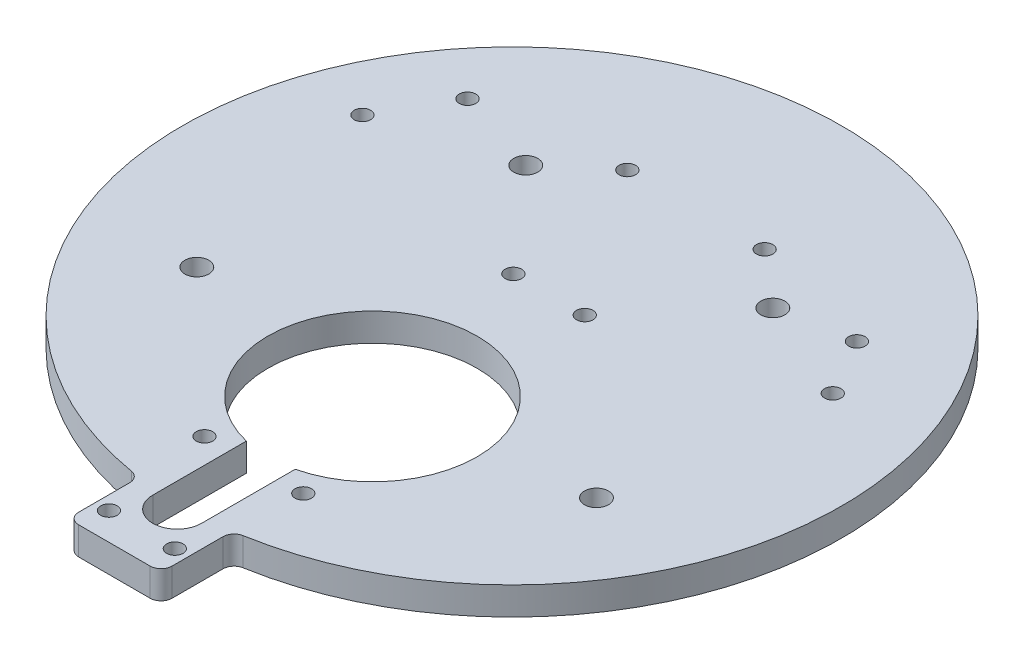
ISO-10303-21;
HEADER;
FILE_DESCRIPTION(('STEP AP214'),'2;1');
FILE_NAME('part.step','',(''),(''),'','','');
FILE_SCHEMA(('AUTOMOTIVE_DESIGN { 1 0 10303 214 1 1 1 1 }'));
ENDSEC;
DATA;
#1=APPLICATION_CONTEXT('core data for automotive mechanical design processes');
#2=APPLICATION_PROTOCOL_DEFINITION('international standard','automotive_design',2000,#1);
#3=PRODUCT_CONTEXT('',#1,'mechanical');
#4=PRODUCT('Part','Part','',(#3));
#5=PRODUCT_RELATED_PRODUCT_CATEGORY('part','',(#4));
#6=PRODUCT_DEFINITION_FORMATION('','',#4);
#7=PRODUCT_DEFINITION_CONTEXT('part definition',#1,'design');
#8=PRODUCT_DEFINITION('design','',#6,#7);
#9=PRODUCT_DEFINITION_SHAPE('','',#8);
#10=(LENGTH_UNIT() NAMED_UNIT(*) SI_UNIT(.MILLI.,.METRE.));
#11=(NAMED_UNIT(*) PLANE_ANGLE_UNIT() SI_UNIT($,.RADIAN.));
#12=(NAMED_UNIT(*) SI_UNIT($,.STERADIAN.) SOLID_ANGLE_UNIT());
#13=UNCERTAINTY_MEASURE_WITH_UNIT(LENGTH_MEASURE(1.E-05),#10,'distance_accuracy_value','');
#14=(GEOMETRIC_REPRESENTATION_CONTEXT(3) GLOBAL_UNCERTAINTY_ASSIGNED_CONTEXT((#13)) GLOBAL_UNIT_ASSIGNED_CONTEXT((#10,
#11,#12)) REPRESENTATION_CONTEXT('',''));
#15=CARTESIAN_POINT('',(0.,0.,0.));
#16=DIRECTION('',(0.,0.,1.));
#17=DIRECTION('',(1.,0.,0.));
#18=AXIS2_PLACEMENT_3D('',#15,#16,#17);
#19=CARTESIAN_POINT('',(0.,5.08,0.));
#20=DIRECTION('',(0.,-1.,0.));
#21=DIRECTION('',(0.,0.,-1.));
#22=AXIS2_PLACEMENT_3D('',#19,#20,#21);
#23=CYLINDRICAL_SURFACE('',#22,60.);
#24=CARTESIAN_POINT('',(0.,5.08,0.));
#25=DIRECTION('',(0.,1.,0.));
#26=DIRECTION('',(0.,0.,1.));
#27=AXIS2_PLACEMENT_3D('',#24,#25,#26);
#28=CIRCLE('',#27,60.);
#29=CARTESIAN_POINT('',(10.1612903225807,5.08,59.1333085407897));
#30=VERTEX_POINT('',#29);
#31=CARTESIAN_POINT('',(-10.1612903225806,5.08,59.1333085407897));
#32=VERTEX_POINT('',#31);
#33=EDGE_CURVE('E230',#30,#32,#28,.T.);
#34=ORIENTED_EDGE('',*,*,#33,.F.);
#35=DIRECTION('',(0.,-1.,0.));
#36=VECTOR('',#35,1.);
#37=CARTESIAN_POINT('',(10.1612903225807,5.08,59.1333085407897));
#38=LINE('',#37,#36);
#39=CARTESIAN_POINT('',(10.1612903225807,0.,59.1333085407897));
#40=VERTEX_POINT('',#39);
#41=EDGE_CURVE('E259',#30,#40,#38,.T.);
#42=ORIENTED_EDGE('',*,*,#41,.T.);
#43=CARTESIAN_POINT('',(0.,0.,0.));
#44=DIRECTION('',(0.,1.,0.));
#45=DIRECTION('',(0.,0.,1.));
#46=AXIS2_PLACEMENT_3D('',#43,#44,#45);
#47=CIRCLE('',#46,60.);
#48=CARTESIAN_POINT('',(-10.1612903225806,0.,59.1333085407897));
#49=VERTEX_POINT('',#48);
#50=EDGE_CURVE('E227',#40,#49,#47,.T.);
#51=ORIENTED_EDGE('',*,*,#50,.T.);
#52=DIRECTION('',(0.,-1.,0.));
#53=VECTOR('',#52,1.);
#54=CARTESIAN_POINT('',(-10.1612903225806,5.08,59.1333085407897));
#55=LINE('',#54,#53);
#56=EDGE_CURVE('E256',#49,#32,#55,.F.);
#57=ORIENTED_EDGE('',*,*,#56,.T.);
#58=EDGE_LOOP('',(#34,#42,#51,#57));
#59=FACE_BOUND('',#58,.T.);
#60=ADVANCED_FACE('F35',(#59),#23,.T.);
#61=CARTESIAN_POINT('',(0.,5.08,0.));
#62=DIRECTION('',(0.,1.,0.));
#63=DIRECTION('',(0.,0.,1.));
#64=AXIS2_PLACEMENT_3D('',#61,#62,#63);
#65=PLANE('',#64);
#66=CARTESIAN_POINT('',(9.,5.08,47.));
#67=DIRECTION('',(0.,1.,0.));
#68=DIRECTION('',(0.,0.,1.));
#69=AXIS2_PLACEMENT_3D('',#66,#67,#68);
#70=CIRCLE('',#69,1.5);
#71=CARTESIAN_POINT('',(9.,5.08,48.5));
#72=VERTEX_POINT('',#71);
#73=EDGE_CURVE('E684',#72,#72,#70,.T.);
#74=ORIENTED_EDGE('',*,*,#73,.F.);
#75=EDGE_LOOP('',(#74));
#76=FACE_BOUND('',#75,.T.);
#77=CARTESIAN_POINT('',(-9.,5.08,47.));
#78=DIRECTION('',(0.,1.,0.));
#79=DIRECTION('',(0.,0.,1.));
#80=AXIS2_PLACEMENT_3D('',#77,#78,#79);
#81=CIRCLE('',#80,1.5);
#82=CARTESIAN_POINT('',(-9.,5.08,48.5));
#83=VERTEX_POINT('',#82);
#84=EDGE_CURVE('E678',#83,#83,#81,.T.);
#85=ORIENTED_EDGE('',*,*,#84,.F.);
#86=EDGE_LOOP('',(#85));
#87=FACE_BOUND('',#86,.T.);
#88=CARTESIAN_POINT('',(6.,5.08,67.394865097919));
#89=DIRECTION('',(0.,1.,0.));
#90=DIRECTION('',(0.,0.,1.));
#91=AXIS2_PLACEMENT_3D('',#88,#89,#90);
#92=CIRCLE('',#91,1.5);
#93=CARTESIAN_POINT('',(6.,5.08,68.894865097919));
#94=VERTEX_POINT('',#93);
#95=EDGE_CURVE('E672',#94,#94,#92,.T.);
#96=ORIENTED_EDGE('',*,*,#95,.F.);
#97=EDGE_LOOP('',(#96));
#98=FACE_BOUND('',#97,.T.);
#99=CARTESIAN_POINT('',(-6.,5.08,67.394865097919));
#100=DIRECTION('',(0.,1.,0.));
#101=DIRECTION('',(0.,0.,1.));
#102=AXIS2_PLACEMENT_3D('',#99,#100,#101);
#103=CIRCLE('',#102,1.5);
#104=CARTESIAN_POINT('',(-6.,5.08,68.894865097919));
#105=VERTEX_POINT('',#104);
#106=EDGE_CURVE('E662',#105,#105,#103,.T.);
#107=ORIENTED_EDGE('',*,*,#106,.F.);
#108=EDGE_LOOP('',(#107));
#109=FACE_BOUND('',#108,.T.);
#110=DIRECTION('',(0.,0.,-1.));
#111=VECTOR('',#110,1.);
#112=CARTESIAN_POINT('',(4.44500000000001,5.08,60.964865097919));
#113=LINE('',#112,#111);
#114=CARTESIAN_POINT('',(4.445,5.08,60.964865097919));
#115=VERTEX_POINT('',#114);
#116=CARTESIAN_POINT('',(4.44499999999999,5.08,43.9241592251848));
#117=VERTEX_POINT('',#116);
#118=EDGE_CURVE('E129',#115,#117,#113,.T.);
#119=ORIENTED_EDGE('',*,*,#118,.F.);
#120=CARTESIAN_POINT('',(0.,5.08,60.964865097919));
#121=DIRECTION('',(0.,1.,0.));
#122=DIRECTION('',(0.,0.,1.));
#123=AXIS2_PLACEMENT_3D('',#120,#121,#122);
#124=CIRCLE('',#123,4.445);
#125=CARTESIAN_POINT('',(-4.44499999999998,5.08,60.964865097919));
#126=VERTEX_POINT('',#125);
#127=EDGE_CURVE('E145',#126,#115,#124,.T.);
#128=ORIENTED_EDGE('',*,*,#127,.F.);
#129=DIRECTION('',(0.,0.,1.));
#130=VECTOR('',#129,1.);
#131=CARTESIAN_POINT('',(-4.44499999999998,5.08,60.964865097919));
#132=LINE('',#131,#130);
#133=CARTESIAN_POINT('',(-4.44500000000001,5.08,43.9241592251848));
#134=VERTEX_POINT('',#133);
#135=EDGE_CURVE('E656',#134,#126,#132,.T.);
#136=ORIENTED_EDGE('',*,*,#135,.F.);
#137=CARTESIAN_POINT('',(0.,5.08,25.4));
#138=DIRECTION('',(0.,1.,0.));
#139=DIRECTION('',(0.,0.,1.));
#140=AXIS2_PLACEMENT_3D('',#137,#138,#139);
#141=CIRCLE('',#140,19.05);
#142=EDGE_CURVE('E150',#117,#134,#141,.T.);
#143=ORIENTED_EDGE('',*,*,#142,.F.);
#144=EDGE_LOOP('',(#119,#128,#136,#143));
#145=FACE_BOUND('',#144,.T.);
#146=DIRECTION('',(1.,0.,0.));
#147=VECTOR('',#146,1.);
#148=CARTESIAN_POINT('',(-8.49999999999999,5.08,72.394865097919));
#149=LINE('',#148,#147);
#150=CARTESIAN_POINT('',(-6.49999999999999,5.08,72.394865097919));
#151=VERTEX_POINT('',#150);
#152=CARTESIAN_POINT('',(6.50000000000001,5.08,72.394865097919));
#153=VERTEX_POINT('',#152);
#154=EDGE_CURVE('E158',#151,#153,#149,.T.);
#155=ORIENTED_EDGE('',*,*,#154,.T.);
#156=CARTESIAN_POINT('',(6.50000000000001,5.08,70.394865097919));
#157=DIRECTION('',(0.,1.,0.));
#158=DIRECTION('',(0.,0.,1.));
#159=AXIS2_PLACEMENT_3D('',#156,#157,#158);
#160=CIRCLE('',#159,2.);
#161=CARTESIAN_POINT('',(8.50000000000001,5.08,70.394865097919));
#162=VERTEX_POINT('',#161);
#163=EDGE_CURVE('E241',#153,#162,#160,.T.);
#164=ORIENTED_EDGE('',*,*,#163,.T.);
#165=DIRECTION('',(0.,0.,-1.));
#166=VECTOR('',#165,1.);
#167=CARTESIAN_POINT('',(8.50000000000001,5.08,72.394865097919));
#168=LINE('',#167,#166);
#169=CARTESIAN_POINT('',(8.50000000000001,5.08,61.1044188254827));
#170=VERTEX_POINT('',#169);
#171=EDGE_CURVE('E285',#162,#170,#168,.T.);
#172=ORIENTED_EDGE('',*,*,#171,.T.);
#173=CARTESIAN_POINT('',(10.5,5.08,61.1044188254827));
#174=DIRECTION('',(0.,1.,0.));
#175=DIRECTION('',(0.,0.,1.));
#176=AXIS2_PLACEMENT_3D('',#173,#174,#175);
#177=CIRCLE('',#176,2.);
#178=EDGE_CURVE('E262',#170,#30,#177,.F.);
#179=ORIENTED_EDGE('',*,*,#178,.T.);
#180=ORIENTED_EDGE('',*,*,#33,.T.);
#181=CARTESIAN_POINT('',(-10.5,5.08,61.1044188254827));
#182=DIRECTION('',(0.,1.,0.));
#183=DIRECTION('',(0.,0.,1.));
#184=AXIS2_PLACEMENT_3D('',#181,#182,#183);
#185=CIRCLE('',#184,2.);
#186=CARTESIAN_POINT('',(-8.49999999999999,5.08,61.1044188254827));
#187=VERTEX_POINT('',#186);
#188=EDGE_CURVE('E43',#32,#187,#185,.F.);
#189=ORIENTED_EDGE('',*,*,#188,.T.);
#190=DIRECTION('',(0.,0.,1.));
#191=VECTOR('',#190,1.);
#192=CARTESIAN_POINT('',(-8.49999999999999,5.08,72.394865097919));
#193=LINE('',#192,#191);
#194=CARTESIAN_POINT('',(-8.49999999999999,5.08,70.394865097919));
#195=VERTEX_POINT('',#194);
#196=EDGE_CURVE('E296',#187,#195,#193,.T.);
#197=ORIENTED_EDGE('',*,*,#196,.T.);
#198=CARTESIAN_POINT('',(-6.49999999999999,5.08,70.394865097919));
#199=DIRECTION('',(0.,1.,0.));
#200=DIRECTION('',(0.,0.,1.));
#201=AXIS2_PLACEMENT_3D('',#198,#199,#200);
#202=CIRCLE('',#201,2.);
#203=EDGE_CURVE('E239',#195,#151,#202,.T.);
#204=ORIENTED_EDGE('',*,*,#203,.T.);
#205=EDGE_LOOP('',(#155,#164,#172,#179,#180,#189,#197,#204));
#206=FACE_BOUND('',#205,.T.);
#207=CARTESIAN_POINT('',(22.5,5.08,-25.));
#208=DIRECTION('',(0.,1.,0.));
#209=DIRECTION('',(0.,0.,1.));
#210=AXIS2_PLACEMENT_3D('',#207,#208,#209);
#211=CIRCLE('',#210,2.1828125);
#212=CARTESIAN_POINT('',(22.5,5.08,-22.8171875));
#213=VERTEX_POINT('',#212);
#214=EDGE_CURVE('E149',#213,#213,#211,.T.);
#215=ORIENTED_EDGE('',*,*,#214,.F.);
#216=EDGE_LOOP('',(#215));
#217=FACE_BOUND('',#216,.T.);
#218=CARTESIAN_POINT('',(-22.5,5.08,-25.));
#219=DIRECTION('',(0.,1.,0.));
#220=DIRECTION('',(0.,0.,1.));
#221=AXIS2_PLACEMENT_3D('',#218,#219,#220);
#222=CIRCLE('',#221,2.1828125);
#223=CARTESIAN_POINT('',(-22.5,5.08,-22.8171875));
#224=VERTEX_POINT('',#223);
#225=EDGE_CURVE('E162',#224,#224,#222,.T.);
#226=ORIENTED_EDGE('',*,*,#225,.F.);
#227=EDGE_LOOP('',(#226));
#228=FACE_BOUND('',#227,.T.);
#229=CARTESIAN_POINT('',(-38.2943859866371,5.08,-30.192177826491));
#230=DIRECTION('',(0.,1.,0.));
#231=DIRECTION('',(0.,0.,1.));
#232=AXIS2_PLACEMENT_3D('',#229,#230,#231);
#233=CIRCLE('',#232,1.5);
#234=CARTESIAN_POINT('',(-38.2943859866371,5.08,-28.692177826491));
#235=VERTEX_POINT('',#234);
#236=EDGE_CURVE('E167',#235,#235,#233,.T.);
#237=ORIENTED_EDGE('',*,*,#236,.F.);
#238=EDGE_LOOP('',(#237));
#239=FACE_BOUND('',#238,.T.);
#240=CARTESIAN_POINT('',(-45.294385986637,5.08,-18.0678221735088));
#241=DIRECTION('',(0.,1.,0.));
#242=DIRECTION('',(0.,0.,1.));
#243=AXIS2_PLACEMENT_3D('',#240,#241,#242);
#244=CIRCLE('',#243,1.5);
#245=CARTESIAN_POINT('',(-45.294385986637,5.08,-16.5678221735088));
#246=VERTEX_POINT('',#245);
#247=EDGE_CURVE('E173',#246,#246,#244,.T.);
#248=ORIENTED_EDGE('',*,*,#247,.F.);
#249=EDGE_LOOP('',(#248));
#250=FACE_BOUND('',#249,.T.);
#251=CARTESIAN_POINT('',(41.4212169661505,5.08,-16.9863475352933));
#252=DIRECTION('',(0.,1.,0.));
#253=DIRECTION('',(0.,0.,1.));
#254=AXIS2_PLACEMENT_3D('',#251,#252,#253);
#255=CIRCLE('',#254,1.5);
#256=CARTESIAN_POINT('',(41.4212169661505,5.08,-15.4863475352933));
#257=VERTEX_POINT('',#256);
#258=EDGE_CURVE('E179',#257,#257,#255,.T.);
#259=ORIENTED_EDGE('',*,*,#258,.F.);
#260=EDGE_LOOP('',(#259));
#261=FACE_BOUND('',#260,.T.);
#262=CARTESIAN_POINT('',(35.4212169661505,5.08,-27.3786523807065));
#263=DIRECTION('',(0.,1.,0.));
#264=DIRECTION('',(0.,0.,1.));
#265=AXIS2_PLACEMENT_3D('',#262,#263,#264);
#266=CIRCLE('',#265,1.5);
#267=CARTESIAN_POINT('',(35.4212169661505,5.08,-25.8786523807065));
#268=VERTEX_POINT('',#267);
#269=EDGE_CURVE('E185',#268,#268,#266,.T.);
#270=ORIENTED_EDGE('',*,*,#269,.F.);
#271=EDGE_LOOP('',(#270));
#272=FACE_BOUND('',#271,.T.);
#273=CARTESIAN_POINT('',(12.5,5.08,-33.500000056));
#274=DIRECTION('',(0.,1.,0.));
#275=DIRECTION('',(0.,0.,1.));
#276=AXIS2_PLACEMENT_3D('',#273,#274,#275);
#277=CIRCLE('',#276,1.5);
#278=CARTESIAN_POINT('',(12.5,5.08,-32.000000056));
#279=VERTEX_POINT('',#278);
#280=EDGE_CURVE('E191',#279,#279,#277,.T.);
#281=ORIENTED_EDGE('',*,*,#280,.F.);
#282=EDGE_LOOP('',(#281));
#283=FACE_BOUND('',#282,.T.);
#284=CARTESIAN_POINT('',(-12.5,5.08,-33.500000056));
#285=DIRECTION('',(0.,1.,0.));
#286=DIRECTION('',(0.,0.,1.));
#287=AXIS2_PLACEMENT_3D('',#284,#285,#286);
#288=CIRCLE('',#287,1.5);
#289=CARTESIAN_POINT('',(-12.5,5.08,-32.000000056));
#290=VERTEX_POINT('',#289);
#291=EDGE_CURVE('E197',#290,#290,#288,.T.);
#292=ORIENTED_EDGE('',*,*,#291,.F.);
#293=EDGE_LOOP('',(#292));
#294=FACE_BOUND('',#293,.T.);
#295=CARTESIAN_POINT('',(6.5,5.08,-6.749999962));
#296=DIRECTION('',(0.,1.,0.));
#297=DIRECTION('',(0.,0.,1.));
#298=AXIS2_PLACEMENT_3D('',#295,#296,#297);
#299=CIRCLE('',#298,1.5);
#300=CARTESIAN_POINT('',(6.5,5.08,-5.249999962));
#301=VERTEX_POINT('',#300);
#302=EDGE_CURVE('E203',#301,#301,#299,.T.);
#303=ORIENTED_EDGE('',*,*,#302,.F.);
#304=EDGE_LOOP('',(#303));
#305=FACE_BOUND('',#304,.T.);
#306=CARTESIAN_POINT('',(-6.5,5.08,-6.749999962));
#307=DIRECTION('',(0.,1.,0.));
#308=DIRECTION('',(0.,0.,1.));
#309=AXIS2_PLACEMENT_3D('',#306,#307,#308);
#310=CIRCLE('',#309,1.5);
#311=CARTESIAN_POINT('',(-6.5,5.08,-5.249999962));
#312=VERTEX_POINT('',#311);
#313=EDGE_CURVE('E209',#312,#312,#310,.T.);
#314=ORIENTED_EDGE('',*,*,#313,.F.);
#315=EDGE_LOOP('',(#314));
#316=FACE_BOUND('',#315,.T.);
#317=CARTESIAN_POINT('',(36.3860573781084,5.08,21.0075000219999));
#318=DIRECTION('',(0.,1.,0.));
#319=DIRECTION('',(0.866025403784436,0.,-0.500000000000004));
#320=AXIS2_PLACEMENT_3D('',#317,#318,#319);
#321=CIRCLE('',#320,2.1828125);
#322=CARTESIAN_POINT('',(38.2764284548066,5.08,19.9160937719999));
#323=VERTEX_POINT('',#322);
#324=EDGE_CURVE('E215',#323,#323,#321,.T.);
#325=ORIENTED_EDGE('',*,*,#324,.F.);
#326=EDGE_LOOP('',(#325));
#327=FACE_BOUND('',#326,.T.);
#328=CARTESIAN_POINT('',(-36.3860573781084,5.08,21.0075000219999));
#329=DIRECTION('',(0.,1.,0.));
#330=DIRECTION('',(0.,0.,1.));
#331=AXIS2_PLACEMENT_3D('',#328,#329,#330);
#332=CIRCLE('',#331,2.1828125);
#333=CARTESIAN_POINT('',(-36.3860573781084,5.08,23.1903125219999));
#334=VERTEX_POINT('',#333);
#335=EDGE_CURVE('E221',#334,#334,#332,.T.);
#336=ORIENTED_EDGE('',*,*,#335,.F.);
#337=EDGE_LOOP('',(#336));
#338=FACE_BOUND('',#337,.T.);
#339=ADVANCED_FACE('F283',(#76,#87,#98,#109,#145,#206,#217,#228,#239,#250,#261,#272,#283,#294,
#305,#316,#327,#338),#65,.T.);
#340=CARTESIAN_POINT('',(0.,0.,0.));
#341=DIRECTION('',(0.,1.,0.));
#342=DIRECTION('',(0.,0.,1.));
#343=AXIS2_PLACEMENT_3D('',#340,#341,#342);
#344=PLANE('',#343);
#345=CARTESIAN_POINT('',(9.,0.,47.));
#346=DIRECTION('',(0.,1.,0.));
#347=DIRECTION('',(0.,0.,1.));
#348=AXIS2_PLACEMENT_3D('',#345,#346,#347);
#349=CIRCLE('',#348,1.5);
#350=CARTESIAN_POINT('',(9.,0.,48.5));
#351=VERTEX_POINT('',#350);
#352=EDGE_CURVE('E681',#351,#351,#349,.T.);
#353=ORIENTED_EDGE('',*,*,#352,.T.);
#354=EDGE_LOOP('',(#353));
#355=FACE_BOUND('',#354,.T.);
#356=CARTESIAN_POINT('',(-9.,0.,47.));
#357=DIRECTION('',(0.,1.,0.));
#358=DIRECTION('',(0.,0.,1.));
#359=AXIS2_PLACEMENT_3D('',#356,#357,#358);
#360=CIRCLE('',#359,1.5);
#361=CARTESIAN_POINT('',(-9.,0.,48.5));
#362=VERTEX_POINT('',#361);
#363=EDGE_CURVE('E675',#362,#362,#360,.T.);
#364=ORIENTED_EDGE('',*,*,#363,.T.);
#365=EDGE_LOOP('',(#364));
#366=FACE_BOUND('',#365,.T.);
#367=CARTESIAN_POINT('',(6.,0.,67.394865097919));
#368=DIRECTION('',(0.,1.,0.));
#369=DIRECTION('',(0.,0.,1.));
#370=AXIS2_PLACEMENT_3D('',#367,#368,#369);
#371=CIRCLE('',#370,1.5);
#372=CARTESIAN_POINT('',(6.,0.,68.894865097919));
#373=VERTEX_POINT('',#372);
#374=EDGE_CURVE('E670',#373,#373,#371,.T.);
#375=ORIENTED_EDGE('',*,*,#374,.T.);
#376=EDGE_LOOP('',(#375));
#377=FACE_BOUND('',#376,.T.);
#378=CARTESIAN_POINT('',(-6.,0.,67.394865097919));
#379=DIRECTION('',(0.,1.,0.));
#380=DIRECTION('',(0.,0.,1.));
#381=AXIS2_PLACEMENT_3D('',#378,#379,#380);
#382=CIRCLE('',#381,1.5);
#383=CARTESIAN_POINT('',(-6.,0.,68.894865097919));
#384=VERTEX_POINT('',#383);
#385=EDGE_CURVE('E658',#384,#384,#382,.T.);
#386=ORIENTED_EDGE('',*,*,#385,.T.);
#387=EDGE_LOOP('',(#386));
#388=FACE_BOUND('',#387,.T.);
#389=CARTESIAN_POINT('',(0.,0.,60.964865097919));
#390=DIRECTION('',(0.,1.,0.));
#391=DIRECTION('',(0.,0.,1.));
#392=AXIS2_PLACEMENT_3D('',#389,#390,#391);
#393=CIRCLE('',#392,4.445);
#394=CARTESIAN_POINT('',(-4.44499999999998,0.,60.964865097919));
#395=VERTEX_POINT('',#394);
#396=CARTESIAN_POINT('',(4.445,0.,60.964865097919));
#397=VERTEX_POINT('',#396);
#398=EDGE_CURVE('E135',#395,#397,#393,.T.);
#399=ORIENTED_EDGE('',*,*,#398,.T.);
#400=DIRECTION('',(0.,0.,-1.));
#401=VECTOR('',#400,1.);
#402=CARTESIAN_POINT('',(4.44500000000001,0.,60.964865097919));
#403=LINE('',#402,#401);
#404=CARTESIAN_POINT('',(4.44500000000001,0.,43.9241592251848));
#405=VERTEX_POINT('',#404);
#406=EDGE_CURVE('E126',#397,#405,#403,.T.);
#407=ORIENTED_EDGE('',*,*,#406,.T.);
#408=CARTESIAN_POINT('',(0.,0.,25.4));
#409=DIRECTION('',(0.,1.,0.));
#410=DIRECTION('',(0.,0.,1.));
#411=AXIS2_PLACEMENT_3D('',#408,#409,#410);
#412=CIRCLE('',#411,19.05);
#413=CARTESIAN_POINT('',(-4.44500000000001,0.,43.9241592251848));
#414=VERTEX_POINT('',#413);
#415=EDGE_CURVE('E142',#405,#414,#412,.T.);
#416=ORIENTED_EDGE('',*,*,#415,.T.);
#417=DIRECTION('',(0.,0.,1.));
#418=VECTOR('',#417,1.);
#419=CARTESIAN_POINT('',(-4.44499999999998,0.,60.964865097919));
#420=LINE('',#419,#418);
#421=EDGE_CURVE('E144',#414,#395,#420,.T.);
#422=ORIENTED_EDGE('',*,*,#421,.T.);
#423=EDGE_LOOP('',(#399,#407,#416,#422));
#424=FACE_BOUND('',#423,.T.);
#425=CARTESIAN_POINT('',(22.5,0.,-25.));
#426=DIRECTION('',(0.,1.,0.));
#427=DIRECTION('',(0.,0.,1.));
#428=AXIS2_PLACEMENT_3D('',#425,#426,#427);
#429=CIRCLE('',#428,2.1828125);
#430=CARTESIAN_POINT('',(22.5,0.,-22.8171875));
#431=VERTEX_POINT('',#430);
#432=EDGE_CURVE('E153',#431,#431,#429,.T.);
#433=ORIENTED_EDGE('',*,*,#432,.T.);
#434=EDGE_LOOP('',(#433));
#435=FACE_BOUND('',#434,.T.);
#436=CARTESIAN_POINT('',(-22.5,0.,-25.));
#437=DIRECTION('',(0.,1.,0.));
#438=DIRECTION('',(0.,0.,1.));
#439=AXIS2_PLACEMENT_3D('',#436,#437,#438);
#440=CIRCLE('',#439,2.1828125);
#441=CARTESIAN_POINT('',(-22.5,0.,-22.8171875));
#442=VERTEX_POINT('',#441);
#443=EDGE_CURVE('E164',#442,#442,#440,.T.);
#444=ORIENTED_EDGE('',*,*,#443,.T.);
#445=EDGE_LOOP('',(#444));
#446=FACE_BOUND('',#445,.T.);
#447=CARTESIAN_POINT('',(-38.2943859866371,0.,-30.192177826491));
#448=DIRECTION('',(0.,1.,0.));
#449=DIRECTION('',(0.,0.,1.));
#450=AXIS2_PLACEMENT_3D('',#447,#448,#449);
#451=CIRCLE('',#450,1.5);
#452=CARTESIAN_POINT('',(-38.2943859866371,0.,-28.692177826491));
#453=VERTEX_POINT('',#452);
#454=EDGE_CURVE('E170',#453,#453,#451,.T.);
#455=ORIENTED_EDGE('',*,*,#454,.T.);
#456=EDGE_LOOP('',(#455));
#457=FACE_BOUND('',#456,.T.);
#458=CARTESIAN_POINT('',(-45.294385986637,0.,-18.0678221735088));
#459=DIRECTION('',(0.,1.,0.));
#460=DIRECTION('',(0.,0.,1.));
#461=AXIS2_PLACEMENT_3D('',#458,#459,#460);
#462=CIRCLE('',#461,1.5);
#463=CARTESIAN_POINT('',(-45.294385986637,0.,-16.5678221735088));
#464=VERTEX_POINT('',#463);
#465=EDGE_CURVE('E176',#464,#464,#462,.T.);
#466=ORIENTED_EDGE('',*,*,#465,.T.);
#467=EDGE_LOOP('',(#466));
#468=FACE_BOUND('',#467,.T.);
#469=CARTESIAN_POINT('',(41.4212169661505,0.,-16.9863475352933));
#470=DIRECTION('',(0.,1.,0.));
#471=DIRECTION('',(0.,0.,1.));
#472=AXIS2_PLACEMENT_3D('',#469,#470,#471);
#473=CIRCLE('',#472,1.5);
#474=CARTESIAN_POINT('',(41.4212169661505,0.,-15.4863475352933));
#475=VERTEX_POINT('',#474);
#476=EDGE_CURVE('E182',#475,#475,#473,.T.);
#477=ORIENTED_EDGE('',*,*,#476,.T.);
#478=EDGE_LOOP('',(#477));
#479=FACE_BOUND('',#478,.T.);
#480=CARTESIAN_POINT('',(35.4212169661505,0.,-27.3786523807065));
#481=DIRECTION('',(0.,1.,0.));
#482=DIRECTION('',(0.,0.,1.));
#483=AXIS2_PLACEMENT_3D('',#480,#481,#482);
#484=CIRCLE('',#483,1.5);
#485=CARTESIAN_POINT('',(35.4212169661505,0.,-25.8786523807065));
#486=VERTEX_POINT('',#485);
#487=EDGE_CURVE('E188',#486,#486,#484,.T.);
#488=ORIENTED_EDGE('',*,*,#487,.T.);
#489=EDGE_LOOP('',(#488));
#490=FACE_BOUND('',#489,.T.);
#491=CARTESIAN_POINT('',(12.5,0.,-33.500000056));
#492=DIRECTION('',(0.,1.,0.));
#493=DIRECTION('',(0.,0.,1.));
#494=AXIS2_PLACEMENT_3D('',#491,#492,#493);
#495=CIRCLE('',#494,1.5);
#496=CARTESIAN_POINT('',(12.5,0.,-32.000000056));
#497=VERTEX_POINT('',#496);
#498=EDGE_CURVE('E194',#497,#497,#495,.T.);
#499=ORIENTED_EDGE('',*,*,#498,.T.);
#500=EDGE_LOOP('',(#499));
#501=FACE_BOUND('',#500,.T.);
#502=CARTESIAN_POINT('',(-12.5,0.,-33.500000056));
#503=DIRECTION('',(0.,1.,0.));
#504=DIRECTION('',(0.,0.,1.));
#505=AXIS2_PLACEMENT_3D('',#502,#503,#504);
#506=CIRCLE('',#505,1.5);
#507=CARTESIAN_POINT('',(-12.5,0.,-32.000000056));
#508=VERTEX_POINT('',#507);
#509=EDGE_CURVE('E200',#508,#508,#506,.T.);
#510=ORIENTED_EDGE('',*,*,#509,.T.);
#511=EDGE_LOOP('',(#510));
#512=FACE_BOUND('',#511,.T.);
#513=CARTESIAN_POINT('',(6.5,0.,-6.749999962));
#514=DIRECTION('',(0.,1.,0.));
#515=DIRECTION('',(0.,0.,1.));
#516=AXIS2_PLACEMENT_3D('',#513,#514,#515);
#517=CIRCLE('',#516,1.5);
#518=CARTESIAN_POINT('',(6.5,0.,-5.249999962));
#519=VERTEX_POINT('',#518);
#520=EDGE_CURVE('E206',#519,#519,#517,.T.);
#521=ORIENTED_EDGE('',*,*,#520,.T.);
#522=EDGE_LOOP('',(#521));
#523=FACE_BOUND('',#522,.T.);
#524=CARTESIAN_POINT('',(-6.5,0.,-6.749999962));
#525=DIRECTION('',(0.,1.,0.));
#526=DIRECTION('',(0.,0.,1.));
#527=AXIS2_PLACEMENT_3D('',#524,#525,#526);
#528=CIRCLE('',#527,1.5);
#529=CARTESIAN_POINT('',(-6.5,0.,-5.249999962));
#530=VERTEX_POINT('',#529);
#531=EDGE_CURVE('E212',#530,#530,#528,.T.);
#532=ORIENTED_EDGE('',*,*,#531,.T.);
#533=EDGE_LOOP('',(#532));
#534=FACE_BOUND('',#533,.T.);
#535=CARTESIAN_POINT('',(36.3860573781084,0.,21.0075000219999));
#536=DIRECTION('',(0.,1.,0.));
#537=DIRECTION('',(0.866025403784436,0.,-0.500000000000004));
#538=AXIS2_PLACEMENT_3D('',#535,#536,#537);
#539=CIRCLE('',#538,2.1828125);
#540=CARTESIAN_POINT('',(38.2764284548066,0.,19.9160937719999));
#541=VERTEX_POINT('',#540);
#542=EDGE_CURVE('E218',#541,#541,#539,.T.);
#543=ORIENTED_EDGE('',*,*,#542,.T.);
#544=EDGE_LOOP('',(#543));
#545=FACE_BOUND('',#544,.T.);
#546=CARTESIAN_POINT('',(-36.3860573781084,0.,21.0075000219999));
#547=DIRECTION('',(0.,1.,0.));
#548=DIRECTION('',(0.,0.,1.));
#549=AXIS2_PLACEMENT_3D('',#546,#547,#548);
#550=CIRCLE('',#549,2.1828125);
#551=CARTESIAN_POINT('',(-36.3860573781084,0.,23.1903125219999));
#552=VERTEX_POINT('',#551);
#553=EDGE_CURVE('E224',#552,#552,#550,.T.);
#554=ORIENTED_EDGE('',*,*,#553,.T.);
#555=EDGE_LOOP('',(#554));
#556=FACE_BOUND('',#555,.T.);
#557=ORIENTED_EDGE('',*,*,#50,.F.);
#558=CARTESIAN_POINT('',(10.5,0.,61.1044188254827));
#559=DIRECTION('',(0.,1.,0.));
#560=DIRECTION('',(0.,0.,1.));
#561=AXIS2_PLACEMENT_3D('',#558,#559,#560);
#562=CIRCLE('',#561,2.);
#563=CARTESIAN_POINT('',(8.50000000000001,0.,61.1044188254827));
#564=VERTEX_POINT('',#563);
#565=EDGE_CURVE('E264',#40,#564,#562,.T.);
#566=ORIENTED_EDGE('',*,*,#565,.T.);
#567=DIRECTION('',(0.,0.,1.));
#568=VECTOR('',#567,1.);
#569=CARTESIAN_POINT('',(8.50000000000001,0.,72.394865097919));
#570=LINE('',#569,#568);
#571=CARTESIAN_POINT('',(8.50000000000001,0.,70.394865097919));
#572=VERTEX_POINT('',#571);
#573=EDGE_CURVE('E155',#564,#572,#570,.T.);
#574=ORIENTED_EDGE('',*,*,#573,.T.);
#575=CARTESIAN_POINT('',(6.50000000000001,0.,70.394865097919));
#576=DIRECTION('',(0.,1.,0.));
#577=DIRECTION('',(0.,0.,1.));
#578=AXIS2_PLACEMENT_3D('',#575,#576,#577);
#579=CIRCLE('',#578,2.);
#580=CARTESIAN_POINT('',(6.50000000000001,0.,72.394865097919));
#581=VERTEX_POINT('',#580);
#582=EDGE_CURVE('E248',#572,#581,#579,.F.);
#583=ORIENTED_EDGE('',*,*,#582,.T.);
#584=DIRECTION('',(-1.,0.,0.));
#585=VECTOR('',#584,1.);
#586=CARTESIAN_POINT('',(-8.49999999999999,0.,72.394865097919));
#587=LINE('',#586,#585);
#588=CARTESIAN_POINT('',(-6.49999999999999,0.,72.394865097919));
#589=VERTEX_POINT('',#588);
#590=EDGE_CURVE('E278',#581,#589,#587,.T.);
#591=ORIENTED_EDGE('',*,*,#590,.T.);
#592=CARTESIAN_POINT('',(-6.49999999999999,0.,70.394865097919));
#593=DIRECTION('',(0.,1.,0.));
#594=DIRECTION('',(0.,0.,1.));
#595=AXIS2_PLACEMENT_3D('',#592,#593,#594);
#596=CIRCLE('',#595,2.);
#597=CARTESIAN_POINT('',(-8.49999999999999,0.,70.394865097919));
#598=VERTEX_POINT('',#597);
#599=EDGE_CURVE('E246',#589,#598,#596,.F.);
#600=ORIENTED_EDGE('',*,*,#599,.T.);
#601=DIRECTION('',(0.,0.,-1.));
#602=VECTOR('',#601,1.);
#603=CARTESIAN_POINT('',(-8.49999999999999,0.,72.394865097919));
#604=LINE('',#603,#602);
#605=CARTESIAN_POINT('',(-8.49999999999999,0.,61.1044188254827));
#606=VERTEX_POINT('',#605);
#607=EDGE_CURVE('E290',#598,#606,#604,.T.);
#608=ORIENTED_EDGE('',*,*,#607,.T.);
#609=CARTESIAN_POINT('',(-10.5,0.,61.1044188254827));
#610=DIRECTION('',(0.,1.,0.));
#611=DIRECTION('',(0.,0.,1.));
#612=AXIS2_PLACEMENT_3D('',#609,#610,#611);
#613=CIRCLE('',#612,2.);
#614=EDGE_CURVE('E11',#606,#49,#613,.T.);
#615=ORIENTED_EDGE('',*,*,#614,.T.);
#616=EDGE_LOOP('',(#557,#566,#574,#583,#591,#600,#608,#615));
#617=FACE_BOUND('',#616,.T.);
#618=ADVANCED_FACE('F139',(#355,#366,#377,#388,#424,#435,#446,#457,#468,#479,#490,#501,#512,
#523,#534,#545,#556,#617),#344,.F.);
#619=CARTESIAN_POINT('',(-36.3860573781084,0.,21.0075000219999));
#620=DIRECTION('',(0.,1.,0.));
#621=DIRECTION('',(0.,0.,1.));
#622=AXIS2_PLACEMENT_3D('',#619,#620,#621);
#623=CYLINDRICAL_SURFACE('',#622,2.1828125);
#624=ORIENTED_EDGE('',*,*,#553,.F.);
#625=EDGE_LOOP('',(#624));
#626=FACE_BOUND('',#625,.T.);
#627=ORIENTED_EDGE('',*,*,#335,.T.);
#628=EDGE_LOOP('',(#627));
#629=FACE_BOUND('',#628,.T.);
#630=ADVANCED_FACE('F367',(#626,#629),#623,.F.);
#631=CARTESIAN_POINT('',(36.3860573781084,0.,21.0075000219999));
#632=DIRECTION('',(0.,1.,0.));
#633=DIRECTION('',(0.,0.,1.));
#634=AXIS2_PLACEMENT_3D('',#631,#632,#633);
#635=CYLINDRICAL_SURFACE('',#634,2.1828125);
#636=ORIENTED_EDGE('',*,*,#542,.F.);
#637=EDGE_LOOP('',(#636));
#638=FACE_BOUND('',#637,.T.);
#639=ORIENTED_EDGE('',*,*,#324,.T.);
#640=EDGE_LOOP('',(#639));
#641=FACE_BOUND('',#640,.T.);
#642=ADVANCED_FACE('F566',(#638,#641),#635,.F.);
#643=CARTESIAN_POINT('',(-6.5,0.,-6.749999962));
#644=DIRECTION('',(0.,1.,0.));
#645=DIRECTION('',(0.,0.,1.));
#646=AXIS2_PLACEMENT_3D('',#643,#644,#645);
#647=CYLINDRICAL_SURFACE('',#646,1.5);
#648=ORIENTED_EDGE('',*,*,#531,.F.);
#649=EDGE_LOOP('',(#648));
#650=FACE_BOUND('',#649,.T.);
#651=ORIENTED_EDGE('',*,*,#313,.T.);
#652=EDGE_LOOP('',(#651));
#653=FACE_BOUND('',#652,.T.);
#654=ADVANCED_FACE('F556',(#650,#653),#647,.F.);
#655=CARTESIAN_POINT('',(6.5,0.,-6.749999962));
#656=DIRECTION('',(0.,1.,0.));
#657=DIRECTION('',(0.,0.,1.));
#658=AXIS2_PLACEMENT_3D('',#655,#656,#657);
#659=CYLINDRICAL_SURFACE('',#658,1.5);
#660=ORIENTED_EDGE('',*,*,#520,.F.);
#661=EDGE_LOOP('',(#660));
#662=FACE_BOUND('',#661,.T.);
#663=ORIENTED_EDGE('',*,*,#302,.T.);
#664=EDGE_LOOP('',(#663));
#665=FACE_BOUND('',#664,.T.);
#666=ADVANCED_FACE('F546',(#662,#665),#659,.F.);
#667=CARTESIAN_POINT('',(-12.5,0.,-33.500000056));
#668=DIRECTION('',(0.,1.,0.));
#669=DIRECTION('',(0.,0.,1.));
#670=AXIS2_PLACEMENT_3D('',#667,#668,#669);
#671=CYLINDRICAL_SURFACE('',#670,1.5);
#672=ORIENTED_EDGE('',*,*,#509,.F.);
#673=EDGE_LOOP('',(#672));
#674=FACE_BOUND('',#673,.T.);
#675=ORIENTED_EDGE('',*,*,#291,.T.);
#676=EDGE_LOOP('',(#675));
#677=FACE_BOUND('',#676,.T.);
#678=ADVANCED_FACE('F536',(#674,#677),#671,.F.);
#679=CARTESIAN_POINT('',(12.5,0.,-33.500000056));
#680=DIRECTION('',(0.,1.,0.));
#681=DIRECTION('',(0.,0.,1.));
#682=AXIS2_PLACEMENT_3D('',#679,#680,#681);
#683=CYLINDRICAL_SURFACE('',#682,1.5);
#684=ORIENTED_EDGE('',*,*,#498,.F.);
#685=EDGE_LOOP('',(#684));
#686=FACE_BOUND('',#685,.T.);
#687=ORIENTED_EDGE('',*,*,#280,.T.);
#688=EDGE_LOOP('',(#687));
#689=FACE_BOUND('',#688,.T.);
#690=ADVANCED_FACE('F526',(#686,#689),#683,.F.);
#691=CARTESIAN_POINT('',(35.4212169661505,0.,-27.3786523807065));
#692=DIRECTION('',(0.,1.,0.));
#693=DIRECTION('',(0.,0.,1.));
#694=AXIS2_PLACEMENT_3D('',#691,#692,#693);
#695=CYLINDRICAL_SURFACE('',#694,1.5);
#696=ORIENTED_EDGE('',*,*,#487,.F.);
#697=EDGE_LOOP('',(#696));
#698=FACE_BOUND('',#697,.T.);
#699=ORIENTED_EDGE('',*,*,#269,.T.);
#700=EDGE_LOOP('',(#699));
#701=FACE_BOUND('',#700,.T.);
#702=ADVANCED_FACE('F516',(#698,#701),#695,.F.);
#703=CARTESIAN_POINT('',(41.4212169661505,0.,-16.9863475352933));
#704=DIRECTION('',(0.,1.,0.));
#705=DIRECTION('',(0.,0.,1.));
#706=AXIS2_PLACEMENT_3D('',#703,#704,#705);
#707=CYLINDRICAL_SURFACE('',#706,1.5);
#708=ORIENTED_EDGE('',*,*,#476,.F.);
#709=EDGE_LOOP('',(#708));
#710=FACE_BOUND('',#709,.T.);
#711=ORIENTED_EDGE('',*,*,#258,.T.);
#712=EDGE_LOOP('',(#711));
#713=FACE_BOUND('',#712,.T.);
#714=ADVANCED_FACE('F506',(#710,#713),#707,.F.);
#715=CARTESIAN_POINT('',(-45.294385986637,0.,-18.0678221735088));
#716=DIRECTION('',(0.,1.,0.));
#717=DIRECTION('',(0.,0.,1.));
#718=AXIS2_PLACEMENT_3D('',#715,#716,#717);
#719=CYLINDRICAL_SURFACE('',#718,1.5);
#720=ORIENTED_EDGE('',*,*,#465,.F.);
#721=EDGE_LOOP('',(#720));
#722=FACE_BOUND('',#721,.T.);
#723=ORIENTED_EDGE('',*,*,#247,.T.);
#724=EDGE_LOOP('',(#723));
#725=FACE_BOUND('',#724,.T.);
#726=ADVANCED_FACE('F496',(#722,#725),#719,.F.);
#727=CARTESIAN_POINT('',(-38.2943859866371,0.,-30.192177826491));
#728=DIRECTION('',(0.,1.,0.));
#729=DIRECTION('',(0.,0.,1.));
#730=AXIS2_PLACEMENT_3D('',#727,#728,#729);
#731=CYLINDRICAL_SURFACE('',#730,1.5);
#732=ORIENTED_EDGE('',*,*,#454,.F.);
#733=EDGE_LOOP('',(#732));
#734=FACE_BOUND('',#733,.T.);
#735=ORIENTED_EDGE('',*,*,#236,.T.);
#736=EDGE_LOOP('',(#735));
#737=FACE_BOUND('',#736,.T.);
#738=ADVANCED_FACE('F486',(#734,#737),#731,.F.);
#739=CARTESIAN_POINT('',(-22.5,0.,-25.));
#740=DIRECTION('',(0.,1.,0.));
#741=DIRECTION('',(0.,0.,1.));
#742=AXIS2_PLACEMENT_3D('',#739,#740,#741);
#743=CYLINDRICAL_SURFACE('',#742,2.1828125);
#744=ORIENTED_EDGE('',*,*,#443,.F.);
#745=EDGE_LOOP('',(#744));
#746=FACE_BOUND('',#745,.T.);
#747=ORIENTED_EDGE('',*,*,#225,.T.);
#748=EDGE_LOOP('',(#747));
#749=FACE_BOUND('',#748,.T.);
#750=ADVANCED_FACE('F476',(#746,#749),#743,.F.);
#751=CARTESIAN_POINT('',(22.5,0.,-25.));
#752=DIRECTION('',(0.,1.,0.));
#753=DIRECTION('',(0.,0.,1.));
#754=AXIS2_PLACEMENT_3D('',#751,#752,#753);
#755=CYLINDRICAL_SURFACE('',#754,2.1828125);
#756=ORIENTED_EDGE('',*,*,#432,.F.);
#757=EDGE_LOOP('',(#756));
#758=FACE_BOUND('',#757,.T.);
#759=ORIENTED_EDGE('',*,*,#214,.T.);
#760=EDGE_LOOP('',(#759));
#761=FACE_BOUND('',#760,.T.);
#762=ADVANCED_FACE('F467',(#758,#761),#755,.F.);
#763=CARTESIAN_POINT('',(0.,0.,25.4));
#764=DIRECTION('',(0.,1.,0.));
#765=DIRECTION('',(0.,0.,1.));
#766=AXIS2_PLACEMENT_3D('',#763,#764,#765);
#767=CYLINDRICAL_SURFACE('',#766,19.05);
#768=ORIENTED_EDGE('',*,*,#142,.T.);
#769=DIRECTION('',(0.,1.,0.));
#770=VECTOR('',#769,1.);
#771=CARTESIAN_POINT('',(-4.44500000000001,0.,43.9241592251848));
#772=LINE('',#771,#770);
#773=EDGE_CURVE('E134',#414,#134,#772,.T.);
#774=ORIENTED_EDGE('',*,*,#773,.F.);
#775=ORIENTED_EDGE('',*,*,#415,.F.);
#776=DIRECTION('',(0.,1.,0.));
#777=VECTOR('',#776,1.);
#778=CARTESIAN_POINT('',(4.44500000000001,0.,43.9241592251848));
#779=LINE('',#778,#777);
#780=EDGE_CURVE('E123',#405,#117,#779,.T.);
#781=ORIENTED_EDGE('',*,*,#780,.T.);
#782=EDGE_LOOP('',(#768,#774,#775,#781));
#783=FACE_BOUND('',#782,.T.);
#784=ADVANCED_FACE('F148',(#783),#767,.F.);
#785=CARTESIAN_POINT('',(8.50000000000001,-21.4009345590327,72.394865097919));
#786=DIRECTION('',(1.,0.,0.));
#787=DIRECTION('',(0.,0.,-1.));
#788=AXIS2_PLACEMENT_3D('',#785,#786,#787);
#789=PLANE('',#788);
#790=ORIENTED_EDGE('',*,*,#573,.F.);
#791=DIRECTION('',(0.,-1.,0.));
#792=VECTOR('',#791,1.);
#793=CARTESIAN_POINT('',(8.50000000000001,-21.4009345590327,61.1044188254827));
#794=LINE('',#793,#792);
#795=EDGE_CURVE('E253',#564,#170,#794,.F.);
#796=ORIENTED_EDGE('',*,*,#795,.T.);
#797=ORIENTED_EDGE('',*,*,#171,.F.);
#798=DIRECTION('',(0.,1.,0.));
#799=VECTOR('',#798,1.);
#800=CARTESIAN_POINT('',(8.50000000000001,-21.4009345590327,70.394865097919));
#801=LINE('',#800,#799);
#802=EDGE_CURVE('E243',#162,#572,#801,.F.);
#803=ORIENTED_EDGE('',*,*,#802,.T.);
#804=EDGE_LOOP('',(#790,#796,#797,#803));
#805=FACE_BOUND('',#804,.T.);
#806=ADVANCED_FACE('F273',(#805),#789,.T.);
#807=CARTESIAN_POINT('',(-8.49999999999999,-21.4009345590327,72.394865097919));
#808=DIRECTION('',(0.,0.,1.));
#809=DIRECTION('',(1.,0.,0.));
#810=AXIS2_PLACEMENT_3D('',#807,#808,#809);
#811=PLANE('',#810);
#812=ORIENTED_EDGE('',*,*,#590,.F.);
#813=DIRECTION('',(0.,1.,0.));
#814=VECTOR('',#813,1.);
#815=CARTESIAN_POINT('',(6.50000000000001,-21.4009345590327,72.394865097919));
#816=LINE('',#815,#814);
#817=EDGE_CURVE('E236',#581,#153,#816,.T.);
#818=ORIENTED_EDGE('',*,*,#817,.T.);
#819=ORIENTED_EDGE('',*,*,#154,.F.);
#820=DIRECTION('',(0.,1.,0.));
#821=VECTOR('',#820,1.);
#822=CARTESIAN_POINT('',(-6.49999999999999,-21.4009345590327,72.394865097919));
#823=LINE('',#822,#821);
#824=EDGE_CURVE('E232',#151,#589,#823,.F.);
#825=ORIENTED_EDGE('',*,*,#824,.T.);
#826=EDGE_LOOP('',(#812,#818,#819,#825));
#827=FACE_BOUND('',#826,.T.);
#828=ADVANCED_FACE('F307',(#827),#811,.T.);
#829=CARTESIAN_POINT('',(-8.49999999999999,-21.4009345590327,72.394865097919));
#830=DIRECTION('',(-1.,0.,0.));
#831=DIRECTION('',(0.,0.,1.));
#832=AXIS2_PLACEMENT_3D('',#829,#830,#831);
#833=PLANE('',#832);
#834=ORIENTED_EDGE('',*,*,#196,.F.);
#835=DIRECTION('',(0.,-1.,0.));
#836=VECTOR('',#835,1.);
#837=CARTESIAN_POINT('',(-8.49999999999999,-21.4009345590327,61.1044188254827));
#838=LINE('',#837,#836);
#839=EDGE_CURVE('E56',#187,#606,#838,.T.);
#840=ORIENTED_EDGE('',*,*,#839,.T.);
#841=ORIENTED_EDGE('',*,*,#607,.F.);
#842=DIRECTION('',(0.,1.,0.));
#843=VECTOR('',#842,1.);
#844=CARTESIAN_POINT('',(-8.49999999999999,-21.4009345590327,70.394865097919));
#845=LINE('',#844,#843);
#846=EDGE_CURVE('E250',#598,#195,#845,.T.);
#847=ORIENTED_EDGE('',*,*,#846,.T.);
#848=EDGE_LOOP('',(#834,#840,#841,#847));
#849=FACE_BOUND('',#848,.T.);
#850=ADVANCED_FACE('F305',(#849),#833,.T.);
#851=CARTESIAN_POINT('',(4.44500000000001,0.,60.964865097919));
#852=DIRECTION('',(1.,0.,0.));
#853=DIRECTION('',(0.,0.,-1.));
#854=AXIS2_PLACEMENT_3D('',#851,#852,#853);
#855=PLANE('',#854);
#856=ORIENTED_EDGE('',*,*,#118,.T.);
#857=ORIENTED_EDGE('',*,*,#780,.F.);
#858=ORIENTED_EDGE('',*,*,#406,.F.);
#859=DIRECTION('',(0.,1.,0.));
#860=VECTOR('',#859,1.);
#861=CARTESIAN_POINT('',(4.445,0.,60.964865097919));
#862=LINE('',#861,#860);
#863=EDGE_CURVE('E299',#397,#115,#862,.T.);
#864=ORIENTED_EDGE('',*,*,#863,.T.);
#865=EDGE_LOOP('',(#856,#857,#858,#864));
#866=FACE_BOUND('',#865,.T.);
#867=ADVANCED_FACE('F125',(#866),#855,.F.);
#868=CARTESIAN_POINT('',(0.,0.,60.964865097919));
#869=DIRECTION('',(0.,1.,0.));
#870=DIRECTION('',(0.,0.,1.));
#871=AXIS2_PLACEMENT_3D('',#868,#869,#870);
#872=CYLINDRICAL_SURFACE('',#871,4.445);
#873=ORIENTED_EDGE('',*,*,#127,.T.);
#874=ORIENTED_EDGE('',*,*,#863,.F.);
#875=ORIENTED_EDGE('',*,*,#398,.F.);
#876=DIRECTION('',(0.,1.,0.));
#877=VECTOR('',#876,1.);
#878=CARTESIAN_POINT('',(-4.44499999999998,0.,60.964865097919));
#879=LINE('',#878,#877);
#880=EDGE_CURVE('E652',#395,#126,#879,.T.);
#881=ORIENTED_EDGE('',*,*,#880,.T.);
#882=EDGE_LOOP('',(#873,#874,#875,#881));
#883=FACE_BOUND('',#882,.T.);
#884=ADVANCED_FACE('F313',(#883),#872,.F.);
#885=CARTESIAN_POINT('',(-4.44499999999998,0.,60.964865097919));
#886=DIRECTION('',(-1.,0.,0.));
#887=DIRECTION('',(0.,0.,1.));
#888=AXIS2_PLACEMENT_3D('',#885,#886,#887);
#889=PLANE('',#888);
#890=ORIENTED_EDGE('',*,*,#135,.T.);
#891=ORIENTED_EDGE('',*,*,#880,.F.);
#892=ORIENTED_EDGE('',*,*,#421,.F.);
#893=ORIENTED_EDGE('',*,*,#773,.T.);
#894=EDGE_LOOP('',(#890,#891,#892,#893));
#895=FACE_BOUND('',#894,.T.);
#896=ADVANCED_FACE('F436',(#895),#889,.F.);
#897=CARTESIAN_POINT('',(-6.,0.,67.394865097919));
#898=DIRECTION('',(0.,1.,0.));
#899=DIRECTION('',(0.,0.,1.));
#900=AXIS2_PLACEMENT_3D('',#897,#898,#899);
#901=CYLINDRICAL_SURFACE('',#900,1.5);
#902=ORIENTED_EDGE('',*,*,#385,.F.);
#903=EDGE_LOOP('',(#902));
#904=FACE_BOUND('',#903,.T.);
#905=ORIENTED_EDGE('',*,*,#106,.T.);
#906=EDGE_LOOP('',(#905));
#907=FACE_BOUND('',#906,.T.);
#908=ADVANCED_FACE('F426',(#904,#907),#901,.F.);
#909=CARTESIAN_POINT('',(6.,0.,67.394865097919));
#910=DIRECTION('',(0.,1.,0.));
#911=DIRECTION('',(0.,0.,1.));
#912=AXIS2_PLACEMENT_3D('',#909,#910,#911);
#913=CYLINDRICAL_SURFACE('',#912,1.5);
#914=ORIENTED_EDGE('',*,*,#374,.F.);
#915=EDGE_LOOP('',(#914));
#916=FACE_BOUND('',#915,.T.);
#917=ORIENTED_EDGE('',*,*,#95,.T.);
#918=EDGE_LOOP('',(#917));
#919=FACE_BOUND('',#918,.T.);
#920=ADVANCED_FACE('F416',(#916,#919),#913,.F.);
#921=CARTESIAN_POINT('',(-9.,0.,47.));
#922=DIRECTION('',(0.,1.,0.));
#923=DIRECTION('',(0.,0.,1.));
#924=AXIS2_PLACEMENT_3D('',#921,#922,#923);
#925=CYLINDRICAL_SURFACE('',#924,1.5);
#926=ORIENTED_EDGE('',*,*,#363,.F.);
#927=EDGE_LOOP('',(#926));
#928=FACE_BOUND('',#927,.T.);
#929=ORIENTED_EDGE('',*,*,#84,.T.);
#930=EDGE_LOOP('',(#929));
#931=FACE_BOUND('',#930,.T.);
#932=ADVANCED_FACE('F406',(#928,#931),#925,.F.);
#933=CARTESIAN_POINT('',(9.,0.,47.));
#934=DIRECTION('',(0.,1.,0.));
#935=DIRECTION('',(0.,0.,1.));
#936=AXIS2_PLACEMENT_3D('',#933,#934,#935);
#937=CYLINDRICAL_SURFACE('',#936,1.5);
#938=ORIENTED_EDGE('',*,*,#352,.F.);
#939=EDGE_LOOP('',(#938));
#940=FACE_BOUND('',#939,.T.);
#941=ORIENTED_EDGE('',*,*,#73,.T.);
#942=EDGE_LOOP('',(#941));
#943=FACE_BOUND('',#942,.T.);
#944=ADVANCED_FACE('F330',(#940,#943),#937,.F.);
#945=CARTESIAN_POINT('',(6.50000000000001,-21.4009345590327,70.394865097919));
#946=DIRECTION('',(0.,1.,0.));
#947=DIRECTION('',(0.,0.,1.));
#948=AXIS2_PLACEMENT_3D('',#945,#946,#947);
#949=CYLINDRICAL_SURFACE('',#948,2.);
#950=ORIENTED_EDGE('',*,*,#582,.F.);
#951=ORIENTED_EDGE('',*,*,#802,.F.);
#952=ORIENTED_EDGE('',*,*,#163,.F.);
#953=ORIENTED_EDGE('',*,*,#817,.F.);
#954=EDGE_LOOP('',(#950,#951,#952,#953));
#955=FACE_BOUND('',#954,.T.);
#956=ADVANCED_FACE('F327',(#955),#949,.T.);
#957=CARTESIAN_POINT('',(-6.49999999999999,-21.4009345590327,70.394865097919));
#958=DIRECTION('',(0.,1.,0.));
#959=DIRECTION('',(0.,0.,1.));
#960=AXIS2_PLACEMENT_3D('',#957,#958,#959);
#961=CYLINDRICAL_SURFACE('',#960,2.);
#962=ORIENTED_EDGE('',*,*,#599,.F.);
#963=ORIENTED_EDGE('',*,*,#824,.F.);
#964=ORIENTED_EDGE('',*,*,#203,.F.);
#965=ORIENTED_EDGE('',*,*,#846,.F.);
#966=EDGE_LOOP('',(#962,#963,#964,#965));
#967=FACE_BOUND('',#966,.T.);
#968=ADVANCED_FACE('F304',(#967),#961,.T.);
#969=CARTESIAN_POINT('',(10.5,5.08,61.1044188254827));
#970=DIRECTION('',(0.,-1.,0.));
#971=DIRECTION('',(0.,0.,-1.));
#972=AXIS2_PLACEMENT_3D('',#969,#970,#971);
#973=CYLINDRICAL_SURFACE('',#972,2.);
#974=ORIENTED_EDGE('',*,*,#565,.F.);
#975=ORIENTED_EDGE('',*,*,#41,.F.);
#976=ORIENTED_EDGE('',*,*,#178,.F.);
#977=ORIENTED_EDGE('',*,*,#795,.F.);
#978=EDGE_LOOP('',(#974,#975,#976,#977));
#979=FACE_BOUND('',#978,.T.);
#980=ADVANCED_FACE('F280',(#979),#973,.F.);
#981=CARTESIAN_POINT('',(-10.5,5.08,61.1044188254827));
#982=DIRECTION('',(0.,-1.,0.));
#983=DIRECTION('',(0.,0.,-1.));
#984=AXIS2_PLACEMENT_3D('',#981,#982,#983);
#985=CYLINDRICAL_SURFACE('',#984,2.);
#986=ORIENTED_EDGE('',*,*,#614,.F.);
#987=ORIENTED_EDGE('',*,*,#839,.F.);
#988=ORIENTED_EDGE('',*,*,#188,.F.);
#989=ORIENTED_EDGE('',*,*,#56,.F.);
#990=EDGE_LOOP('',(#986,#987,#988,#989));
#991=FACE_BOUND('',#990,.T.);
#992=ADVANCED_FACE('F37',(#991),#985,.F.);
#993=CLOSED_SHELL('',(#60,#339,#618,#630,#642,#654,#666,#678,#690,#702,#714,#726,#738,#750,#762,
#784,#806,#828,#850,#867,#884,#896,#908,#920,#932,#944,#956,#968,#980,#992));
#994=MANIFOLD_SOLID_BREP('B2',#993);
#995=ADVANCED_BREP_SHAPE_REPRESENTATION('',(#18,#994),#14);
#996=SHAPE_DEFINITION_REPRESENTATION(#9,#995);
ENDSEC;
END-ISO-10303-21;
